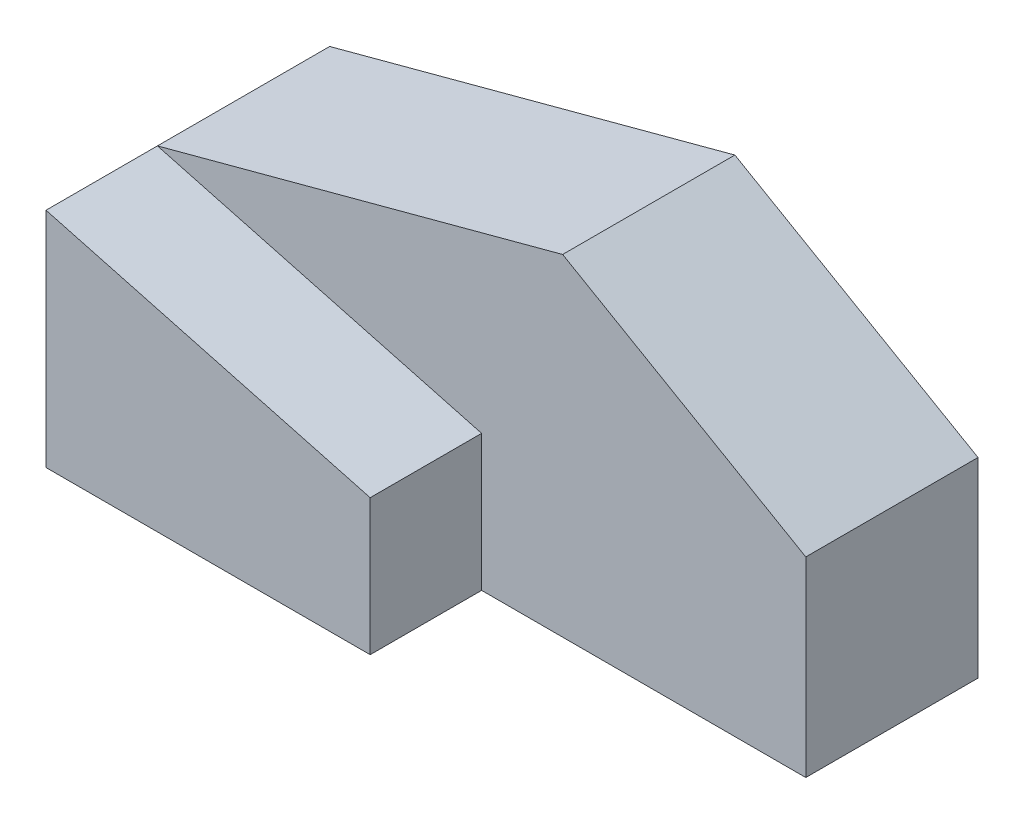
ISO-10303-21;
HEADER;
FILE_DESCRIPTION(('STEP AP214'),'2;1');
FILE_NAME('part.step','',(''),(''),'','','');
FILE_SCHEMA(('AUTOMOTIVE_DESIGN { 1 0 10303 214 1 1 1 1 }'));
ENDSEC;
DATA;
#1=APPLICATION_CONTEXT('core data for automotive mechanical design processes');
#2=APPLICATION_PROTOCOL_DEFINITION('international standard','automotive_design',2000,#1);
#3=PRODUCT_CONTEXT('',#1,'mechanical');
#4=PRODUCT('Part','Part','',(#3));
#5=PRODUCT_RELATED_PRODUCT_CATEGORY('part','',(#4));
#6=PRODUCT_DEFINITION_FORMATION('','',#4);
#7=PRODUCT_DEFINITION_CONTEXT('part definition',#1,'design');
#8=PRODUCT_DEFINITION('design','',#6,#7);
#9=PRODUCT_DEFINITION_SHAPE('','',#8);
#10=(LENGTH_UNIT() NAMED_UNIT(*) SI_UNIT(.MILLI.,.METRE.));
#11=(NAMED_UNIT(*) PLANE_ANGLE_UNIT() SI_UNIT($,.RADIAN.));
#12=(NAMED_UNIT(*) SI_UNIT($,.STERADIAN.) SOLID_ANGLE_UNIT());
#13=UNCERTAINTY_MEASURE_WITH_UNIT(LENGTH_MEASURE(1.E-05),#10,'distance_accuracy_value','');
#14=(GEOMETRIC_REPRESENTATION_CONTEXT(3) GLOBAL_UNCERTAINTY_ASSIGNED_CONTEXT((#13)) GLOBAL_UNIT_ASSIGNED_CONTEXT((#10,
#11,#12)) REPRESENTATION_CONTEXT('',''));
#15=CARTESIAN_POINT('',(0.,0.,0.));
#16=DIRECTION('',(0.,0.,1.));
#17=DIRECTION('',(1.,0.,0.));
#18=AXIS2_PLACEMENT_3D('',#15,#16,#17);
#19=CARTESIAN_POINT('',(0.,0.,13.49375));
#20=DIRECTION('',(0.,0.,-1.));
#21=DIRECTION('',(-1.,0.,0.));
#22=AXIS2_PLACEMENT_3D('',#19,#20,#21);
#23=PLANE('',#22);
#24=DIRECTION('',(-0.965925826289071,0.25881904510251,0.));
#25=VECTOR('',#24,1.);
#26=CARTESIAN_POINT('',(-50.8,34.925,13.49375));
#27=LINE('',#26,#25);
#28=CARTESIAN_POINT('',(0.,21.3131810244995,13.49375));
#29=VERTEX_POINT('',#28);
#30=CARTESIAN_POINT('',(-50.8,34.925,13.49375));
#31=VERTEX_POINT('',#30);
#32=EDGE_CURVE('E126',#29,#31,#27,.T.);
#33=ORIENTED_EDGE('',*,*,#32,.F.);
#34=DIRECTION('',(0.,1.,0.));
#35=VECTOR('',#34,1.);
#36=CARTESIAN_POINT('',(0.,21.3131810244995,13.49375));
#37=LINE('',#36,#35);
#38=CARTESIAN_POINT('',(0.,0.,13.49375));
#39=VERTEX_POINT('',#38);
#40=EDGE_CURVE('E50',#39,#29,#37,.T.);
#41=ORIENTED_EDGE('',*,*,#40,.F.);
#42=DIRECTION('',(1.,0.,0.));
#43=VECTOR('',#42,1.);
#44=CARTESIAN_POINT('',(50.8,0.,13.49375));
#45=LINE('',#44,#43);
#46=CARTESIAN_POINT('',(50.8,0.,13.49375));
#47=VERTEX_POINT('',#46);
#48=EDGE_CURVE('E55',#39,#47,#45,.T.);
#49=ORIENTED_EDGE('',*,*,#48,.T.);
#50=DIRECTION('',(0.,1.,0.));
#51=VECTOR('',#50,1.);
#52=CARTESIAN_POINT('',(50.8,29.942728463252,13.49375));
#53=LINE('',#52,#51);
#54=CARTESIAN_POINT('',(50.8,29.942728463252,13.49375));
#55=VERTEX_POINT('',#54);
#56=EDGE_CURVE('E138',#47,#55,#53,.T.);
#57=ORIENTED_EDGE('',*,*,#56,.T.);
#58=DIRECTION('',(-0.86602540378444,0.499999999999998,0.));
#59=VECTOR('',#58,1.);
#60=CARTESIAN_POINT('',(12.7,51.9397737193766,13.49375));
#61=LINE('',#60,#59);
#62=CARTESIAN_POINT('',(12.7,51.9397737193766,13.49375));
#63=VERTEX_POINT('',#62);
#64=EDGE_CURVE('E87',#55,#63,#61,.T.);
#65=ORIENTED_EDGE('',*,*,#64,.T.);
#66=DIRECTION('',(-0.965925826289067,-0.258819045102526,0.));
#67=VECTOR('',#66,1.);
#68=CARTESIAN_POINT('',(-50.8,34.925,13.49375));
#69=LINE('',#68,#67);
#70=EDGE_CURVE('E141',#63,#31,#69,.T.);
#71=ORIENTED_EDGE('',*,*,#70,.T.);
#72=EDGE_LOOP('',(#33,#41,#49,#57,#65,#71));
#73=FACE_BOUND('',#72,.T.);
#74=ADVANCED_FACE('F33',(#73),#23,.F.);
#75=CARTESIAN_POINT('',(50.8,29.942728463252,13.49375));
#76=DIRECTION('',(-1.,0.,0.));
#77=DIRECTION('',(0.,0.,1.));
#78=AXIS2_PLACEMENT_3D('',#75,#76,#77);
#79=PLANE('',#78);
#80=DIRECTION('',(0.,1.,0.));
#81=VECTOR('',#80,1.);
#82=CARTESIAN_POINT('',(50.8,29.942728463252,-13.49375));
#83=LINE('',#82,#81);
#84=CARTESIAN_POINT('',(50.8,0.,-13.49375));
#85=VERTEX_POINT('',#84);
#86=CARTESIAN_POINT('',(50.8,29.942728463252,-13.49375));
#87=VERTEX_POINT('',#86);
#88=EDGE_CURVE('E127',#85,#87,#83,.T.);
#89=ORIENTED_EDGE('',*,*,#88,.T.);
#90=DIRECTION('',(0.,0.,-1.));
#91=VECTOR('',#90,1.);
#92=CARTESIAN_POINT('',(50.8,29.942728463252,13.49375));
#93=LINE('',#92,#91);
#94=EDGE_CURVE('E11',#55,#87,#93,.T.);
#95=ORIENTED_EDGE('',*,*,#94,.F.);
#96=ORIENTED_EDGE('',*,*,#56,.F.);
#97=DIRECTION('',(0.,0.,-1.));
#98=VECTOR('',#97,1.);
#99=CARTESIAN_POINT('',(50.8,0.,13.49375));
#100=LINE('',#99,#98);
#101=EDGE_CURVE('E147',#47,#85,#100,.T.);
#102=ORIENTED_EDGE('',*,*,#101,.T.);
#103=EDGE_LOOP('',(#89,#95,#96,#102));
#104=FACE_BOUND('',#103,.T.);
#105=ADVANCED_FACE('F35',(#104),#79,.F.);
#106=CARTESIAN_POINT('',(12.7,51.9397737193766,13.49375));
#107=DIRECTION('',(-0.499999999999998,-0.86602540378444,0.));
#108=DIRECTION('',(0.86602540378444,-0.499999999999998,0.));
#109=AXIS2_PLACEMENT_3D('',#106,#107,#108);
#110=PLANE('',#109);
#111=DIRECTION('',(-0.86602540378444,0.499999999999998,0.));
#112=VECTOR('',#111,1.);
#113=CARTESIAN_POINT('',(12.7,51.9397737193766,-13.49375));
#114=LINE('',#113,#112);
#115=CARTESIAN_POINT('',(12.7,51.9397737193766,-13.49375));
#116=VERTEX_POINT('',#115);
#117=EDGE_CURVE('E131',#87,#116,#114,.T.);
#118=ORIENTED_EDGE('',*,*,#117,.T.);
#119=DIRECTION('',(0.,0.,-1.));
#120=VECTOR('',#119,1.);
#121=CARTESIAN_POINT('',(12.7,51.9397737193766,13.49375));
#122=LINE('',#121,#120);
#123=EDGE_CURVE('E42',#63,#116,#122,.T.);
#124=ORIENTED_EDGE('',*,*,#123,.F.);
#125=ORIENTED_EDGE('',*,*,#64,.F.);
#126=ORIENTED_EDGE('',*,*,#94,.T.);
#127=EDGE_LOOP('',(#118,#124,#125,#126));
#128=FACE_BOUND('',#127,.T.);
#129=ADVANCED_FACE('F171',(#128),#110,.F.);
#130=CARTESIAN_POINT('',(-50.8,34.925,13.49375));
#131=DIRECTION('',(0.258819045102526,-0.965925826289067,0.));
#132=DIRECTION('',(0.965925826289067,0.258819045102526,0.));
#133=AXIS2_PLACEMENT_3D('',#130,#131,#132);
#134=PLANE('',#133);
#135=DIRECTION('',(-0.965925826289067,-0.258819045102526,0.));
#136=VECTOR('',#135,1.);
#137=CARTESIAN_POINT('',(-50.8,34.925,-13.49375));
#138=LINE('',#137,#136);
#139=CARTESIAN_POINT('',(-50.8,34.925,-13.49375));
#140=VERTEX_POINT('',#139);
#141=EDGE_CURVE('E192',#116,#140,#138,.T.);
#142=ORIENTED_EDGE('',*,*,#141,.T.);
#143=DIRECTION('',(0.,0.,-1.));
#144=VECTOR('',#143,1.);
#145=CARTESIAN_POINT('',(-50.8,34.925,13.49375));
#146=LINE('',#145,#144);
#147=EDGE_CURVE('E194',#31,#140,#146,.T.);
#148=ORIENTED_EDGE('',*,*,#147,.F.);
#149=ORIENTED_EDGE('',*,*,#70,.F.);
#150=ORIENTED_EDGE('',*,*,#123,.T.);
#151=EDGE_LOOP('',(#142,#148,#149,#150));
#152=FACE_BOUND('',#151,.T.);
#153=ADVANCED_FACE('F181',(#152),#134,.F.);
#154=CARTESIAN_POINT('',(-50.8,0.,13.49375));
#155=DIRECTION('',(1.,0.,0.));
#156=DIRECTION('',(0.,0.,-1.));
#157=AXIS2_PLACEMENT_3D('',#154,#155,#156);
#158=PLANE('',#157);
#159=DIRECTION('',(0.,-1.,0.));
#160=VECTOR('',#159,1.);
#161=CARTESIAN_POINT('',(-50.8,0.,-13.49375));
#162=LINE('',#161,#160);
#163=CARTESIAN_POINT('',(-50.8,0.,-13.49375));
#164=VERTEX_POINT('',#163);
#165=EDGE_CURVE('E196',#140,#164,#162,.T.);
#166=ORIENTED_EDGE('',*,*,#165,.T.);
#167=DIRECTION('',(0.,0.,-1.));
#168=VECTOR('',#167,1.);
#169=CARTESIAN_POINT('',(-50.8,0.,13.49375));
#170=LINE('',#169,#168);
#171=CARTESIAN_POINT('',(-50.8,0.,30.95625));
#172=VERTEX_POINT('',#171);
#173=EDGE_CURVE('E111',#172,#164,#170,.T.);
#174=ORIENTED_EDGE('',*,*,#173,.F.);
#175=DIRECTION('',(0.,-1.,0.));
#176=VECTOR('',#175,1.);
#177=CARTESIAN_POINT('',(-50.8,0.,30.95625));
#178=LINE('',#177,#176);
#179=CARTESIAN_POINT('',(-50.8,34.925,30.95625));
#180=VERTEX_POINT('',#179);
#181=EDGE_CURVE('E104',#180,#172,#178,.T.);
#182=ORIENTED_EDGE('',*,*,#181,.F.);
#183=DIRECTION('',(0.,0.,-1.));
#184=VECTOR('',#183,1.);
#185=CARTESIAN_POINT('',(-50.8,34.925,30.95625));
#186=LINE('',#185,#184);
#187=EDGE_CURVE('E109',#180,#31,#186,.T.);
#188=ORIENTED_EDGE('',*,*,#187,.T.);
#189=ORIENTED_EDGE('',*,*,#147,.T.);
#190=EDGE_LOOP('',(#166,#174,#182,#188,#189));
#191=FACE_BOUND('',#190,.T.);
#192=ADVANCED_FACE('F106',(#191),#158,.F.);
#193=CARTESIAN_POINT('',(50.8,0.,13.49375));
#194=DIRECTION('',(0.,1.,0.));
#195=DIRECTION('',(0.,0.,1.));
#196=AXIS2_PLACEMENT_3D('',#193,#194,#195);
#197=PLANE('',#196);
#198=DIRECTION('',(1.,0.,0.));
#199=VECTOR('',#198,1.);
#200=CARTESIAN_POINT('',(50.8,0.,-13.49375));
#201=LINE('',#200,#199);
#202=EDGE_CURVE('E80',#164,#85,#201,.T.);
#203=ORIENTED_EDGE('',*,*,#202,.T.);
#204=ORIENTED_EDGE('',*,*,#101,.F.);
#205=ORIENTED_EDGE('',*,*,#48,.F.);
#206=DIRECTION('',(0.,0.,-1.));
#207=VECTOR('',#206,1.);
#208=CARTESIAN_POINT('',(0.,0.,30.95625));
#209=LINE('',#208,#207);
#210=CARTESIAN_POINT('',(0.,0.,30.95625));
#211=VERTEX_POINT('',#210);
#212=EDGE_CURVE('E128',#211,#39,#209,.T.);
#213=ORIENTED_EDGE('',*,*,#212,.F.);
#214=DIRECTION('',(1.,0.,0.));
#215=VECTOR('',#214,1.);
#216=CARTESIAN_POINT('',(0.,0.,30.95625));
#217=LINE('',#216,#215);
#218=EDGE_CURVE('E114',#172,#211,#217,.T.);
#219=ORIENTED_EDGE('',*,*,#218,.F.);
#220=ORIENTED_EDGE('',*,*,#173,.T.);
#221=EDGE_LOOP('',(#203,#204,#205,#213,#219,#220));
#222=FACE_BOUND('',#221,.T.);
#223=ADVANCED_FACE('F155',(#222),#197,.F.);
#224=CARTESIAN_POINT('',(0.,0.,-13.49375));
#225=DIRECTION('',(0.,0.,-1.));
#226=DIRECTION('',(-1.,0.,0.));
#227=AXIS2_PLACEMENT_3D('',#224,#225,#226);
#228=PLANE('',#227);
#229=ORIENTED_EDGE('',*,*,#88,.F.);
#230=ORIENTED_EDGE('',*,*,#202,.F.);
#231=ORIENTED_EDGE('',*,*,#165,.F.);
#232=ORIENTED_EDGE('',*,*,#141,.F.);
#233=ORIENTED_EDGE('',*,*,#117,.F.);
#234=EDGE_LOOP('',(#229,#230,#231,#232,#233));
#235=FACE_BOUND('',#234,.T.);
#236=ADVANCED_FACE('F164',(#235),#228,.T.);
#237=CARTESIAN_POINT('',(-50.8,34.925,30.95625));
#238=DIRECTION('',(-0.25881904510251,-0.965925826289071,0.));
#239=DIRECTION('',(0.965925826289071,-0.25881904510251,0.));
#240=AXIS2_PLACEMENT_3D('',#237,#238,#239);
#241=PLANE('',#240);
#242=ORIENTED_EDGE('',*,*,#32,.T.);
#243=ORIENTED_EDGE('',*,*,#187,.F.);
#244=DIRECTION('',(-0.965925826289071,0.25881904510251,0.));
#245=VECTOR('',#244,1.);
#246=CARTESIAN_POINT('',(-50.8,34.925,30.95625));
#247=LINE('',#246,#245);
#248=CARTESIAN_POINT('',(0.,21.3131810244995,30.95625));
#249=VERTEX_POINT('',#248);
#250=EDGE_CURVE('E115',#249,#180,#247,.T.);
#251=ORIENTED_EDGE('',*,*,#250,.F.);
#252=DIRECTION('',(0.,0.,-1.));
#253=VECTOR('',#252,1.);
#254=CARTESIAN_POINT('',(0.,21.3131810244995,30.95625));
#255=LINE('',#254,#253);
#256=EDGE_CURVE('E134',#249,#29,#255,.T.);
#257=ORIENTED_EDGE('',*,*,#256,.T.);
#258=EDGE_LOOP('',(#242,#243,#251,#257));
#259=FACE_BOUND('',#258,.T.);
#260=ADVANCED_FACE('F125',(#259),#241,.F.);
#261=CARTESIAN_POINT('',(0.,21.3131810244995,30.95625));
#262=DIRECTION('',(-1.,0.,0.));
#263=DIRECTION('',(0.,0.,1.));
#264=AXIS2_PLACEMENT_3D('',#261,#262,#263);
#265=PLANE('',#264);
#266=ORIENTED_EDGE('',*,*,#40,.T.);
#267=ORIENTED_EDGE('',*,*,#256,.F.);
#268=DIRECTION('',(0.,1.,0.));
#269=VECTOR('',#268,1.);
#270=CARTESIAN_POINT('',(0.,21.3131810244995,30.95625));
#271=LINE('',#270,#269);
#272=EDGE_CURVE('E120',#211,#249,#271,.T.);
#273=ORIENTED_EDGE('',*,*,#272,.F.);
#274=ORIENTED_EDGE('',*,*,#212,.T.);
#275=EDGE_LOOP('',(#266,#267,#273,#274));
#276=FACE_BOUND('',#275,.T.);
#277=ADVANCED_FACE('F156',(#276),#265,.F.);
#278=CARTESIAN_POINT('',(0.,0.,30.95625));
#279=DIRECTION('',(0.,0.,-1.));
#280=DIRECTION('',(-1.,0.,0.));
#281=AXIS2_PLACEMENT_3D('',#278,#279,#280);
#282=PLANE('',#281);
#283=ORIENTED_EDGE('',*,*,#250,.T.);
#284=ORIENTED_EDGE('',*,*,#181,.T.);
#285=ORIENTED_EDGE('',*,*,#218,.T.);
#286=ORIENTED_EDGE('',*,*,#272,.T.);
#287=EDGE_LOOP('',(#283,#284,#285,#286));
#288=FACE_BOUND('',#287,.T.);
#289=ADVANCED_FACE('F118',(#288),#282,.F.);
#290=CLOSED_SHELL('',(#74,#105,#129,#153,#192,#223,#236,#260,#277,#289));
#291=MANIFOLD_SOLID_BREP('B2',#290);
#292=ADVANCED_BREP_SHAPE_REPRESENTATION('',(#18,#291),#14);
#293=SHAPE_DEFINITION_REPRESENTATION(#9,#292);
ENDSEC;
END-ISO-10303-21;
